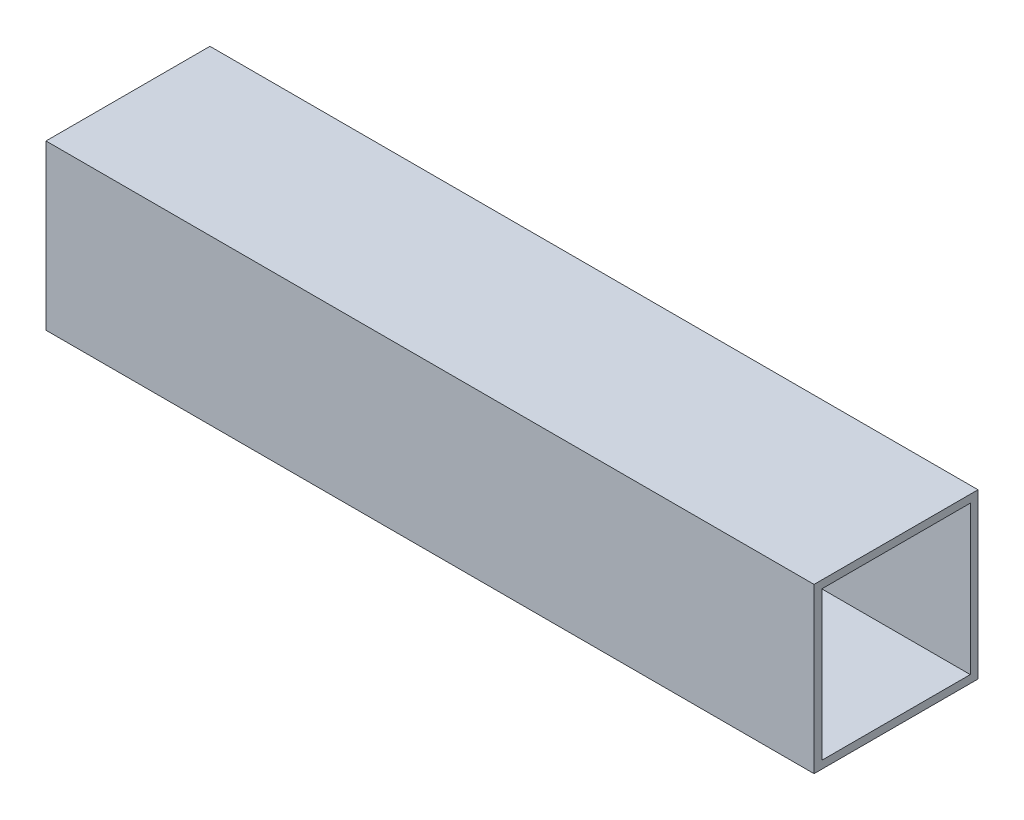
ISO-10303-21;
HEADER;
FILE_DESCRIPTION(('STEP AP214'),'2;1');
FILE_NAME('part.step','',(''),(''),'','','');
FILE_SCHEMA(('AUTOMOTIVE_DESIGN { 1 0 10303 214 1 1 1 1 }'));
ENDSEC;
DATA;
#1=APPLICATION_CONTEXT('core data for automotive mechanical design processes');
#2=APPLICATION_PROTOCOL_DEFINITION('international standard','automotive_design',2000,#1);
#3=PRODUCT_CONTEXT('',#1,'mechanical');
#4=PRODUCT('Part','Part','',(#3));
#5=PRODUCT_RELATED_PRODUCT_CATEGORY('part','',(#4));
#6=PRODUCT_DEFINITION_FORMATION('','',#4);
#7=PRODUCT_DEFINITION_CONTEXT('part definition',#1,'design');
#8=PRODUCT_DEFINITION('design','',#6,#7);
#9=PRODUCT_DEFINITION_SHAPE('','',#8);
#10=(LENGTH_UNIT() NAMED_UNIT(*) SI_UNIT(.MILLI.,.METRE.));
#11=(NAMED_UNIT(*) PLANE_ANGLE_UNIT() SI_UNIT($,.RADIAN.));
#12=(NAMED_UNIT(*) SI_UNIT($,.STERADIAN.) SOLID_ANGLE_UNIT());
#13=UNCERTAINTY_MEASURE_WITH_UNIT(LENGTH_MEASURE(1.E-05),#10,'distance_accuracy_value','');
#14=(GEOMETRIC_REPRESENTATION_CONTEXT(3) GLOBAL_UNCERTAINTY_ASSIGNED_CONTEXT((#13)) GLOBAL_UNIT_ASSIGNED_CONTEXT((#10,
#11,#12)) REPRESENTATION_CONTEXT('',''));
#15=CARTESIAN_POINT('',(0.,0.,0.));
#16=DIRECTION('',(0.,0.,1.));
#17=DIRECTION('',(1.,0.,0.));
#18=AXIS2_PLACEMENT_3D('',#15,#16,#17);
#19=CARTESIAN_POINT('',(0.,25.4,-25.3999999999999));
#20=DIRECTION('',(1.,0.,0.));
#21=DIRECTION('',(0.,0.,-1.));
#22=AXIS2_PLACEMENT_3D('',#19,#20,#21);
#23=PLANE('',#22);
#24=DIRECTION('',(0.,0.,1.));
#25=VECTOR('',#24,1.);
#26=CARTESIAN_POINT('',(0.,24.2,-25.3999999999999));
#27=LINE('',#26,#25);
#28=CARTESIAN_POINT('',(0.,24.2,-24.2));
#29=VERTEX_POINT('',#28);
#30=CARTESIAN_POINT('',(0.,24.2,-1.2));
#31=VERTEX_POINT('',#30);
#32=EDGE_CURVE('E148',#29,#31,#27,.T.);
#33=ORIENTED_EDGE('',*,*,#32,.T.);
#34=DIRECTION('',(0.,-1.,0.));
#35=VECTOR('',#34,1.);
#36=CARTESIAN_POINT('',(0.,25.4,-1.2));
#37=LINE('',#36,#35);
#38=CARTESIAN_POINT('',(0.,1.2,-1.2));
#39=VERTEX_POINT('',#38);
#40=EDGE_CURVE('E152',#31,#39,#37,.T.);
#41=ORIENTED_EDGE('',*,*,#40,.T.);
#42=DIRECTION('',(0.,0.,-1.));
#43=VECTOR('',#42,1.);
#44=CARTESIAN_POINT('',(0.,1.2,-25.3999999999999));
#45=LINE('',#44,#43);
#46=CARTESIAN_POINT('',(0.,1.2,-24.2));
#47=VERTEX_POINT('',#46);
#48=EDGE_CURVE('E139',#39,#47,#45,.T.);
#49=ORIENTED_EDGE('',*,*,#48,.T.);
#50=DIRECTION('',(0.,1.,0.));
#51=VECTOR('',#50,1.);
#52=CARTESIAN_POINT('',(0.,25.4,-24.2));
#53=LINE('',#52,#51);
#54=EDGE_CURVE('E114',#47,#29,#53,.T.);
#55=ORIENTED_EDGE('',*,*,#54,.T.);
#56=EDGE_LOOP('',(#33,#41,#49,#55));
#57=FACE_BOUND('',#56,.T.);
#58=DIRECTION('',(0.,0.,1.));
#59=VECTOR('',#58,1.);
#60=CARTESIAN_POINT('',(0.,0.,-25.3999999999999));
#61=LINE('',#60,#59);
#62=CARTESIAN_POINT('',(0.,0.,-25.3999999999999));
#63=VERTEX_POINT('',#62);
#64=CARTESIAN_POINT('',(0.,0.,0.));
#65=VERTEX_POINT('',#64);
#66=EDGE_CURVE('E156',#63,#65,#61,.T.);
#67=ORIENTED_EDGE('',*,*,#66,.T.);
#68=DIRECTION('',(0.,-1.,0.));
#69=VECTOR('',#68,1.);
#70=CARTESIAN_POINT('',(0.,25.4,0.));
#71=LINE('',#70,#69);
#72=CARTESIAN_POINT('',(0.,25.4,0.));
#73=VERTEX_POINT('',#72);
#74=EDGE_CURVE('E11',#73,#65,#71,.T.);
#75=ORIENTED_EDGE('',*,*,#74,.F.);
#76=DIRECTION('',(0.,0.,1.));
#77=VECTOR('',#76,1.);
#78=CARTESIAN_POINT('',(0.,25.4,-25.3999999999999));
#79=LINE('',#78,#77);
#80=CARTESIAN_POINT('',(0.,25.4,-25.3999999999999));
#81=VERTEX_POINT('',#80);
#82=EDGE_CURVE('E157',#81,#73,#79,.T.);
#83=ORIENTED_EDGE('',*,*,#82,.F.);
#84=DIRECTION('',(0.,-1.,0.));
#85=VECTOR('',#84,1.);
#86=CARTESIAN_POINT('',(0.,25.4,-25.3999999999999));
#87=LINE('',#86,#85);
#88=EDGE_CURVE('E171',#81,#63,#87,.T.);
#89=ORIENTED_EDGE('',*,*,#88,.T.);
#90=EDGE_LOOP('',(#67,#75,#83,#89));
#91=FACE_BOUND('',#90,.T.);
#92=ADVANCED_FACE('F43',(#57,#91),#23,.F.);
#93=CARTESIAN_POINT('',(0.,25.4,0.));
#94=DIRECTION('',(0.,0.,-1.));
#95=DIRECTION('',(-1.,0.,0.));
#96=AXIS2_PLACEMENT_3D('',#93,#94,#95);
#97=PLANE('',#96);
#98=DIRECTION('',(1.,0.,0.));
#99=VECTOR('',#98,1.);
#100=CARTESIAN_POINT('',(0.,0.,0.));
#101=LINE('',#100,#99);
#102=CARTESIAN_POINT('',(119.,0.,0.));
#103=VERTEX_POINT('',#102);
#104=EDGE_CURVE('E175',#65,#103,#101,.T.);
#105=ORIENTED_EDGE('',*,*,#104,.T.);
#106=DIRECTION('',(0.,-1.,0.));
#107=VECTOR('',#106,1.);
#108=CARTESIAN_POINT('',(119.,25.4,0.));
#109=LINE('',#108,#107);
#110=CARTESIAN_POINT('',(119.,25.4,0.));
#111=VERTEX_POINT('',#110);
#112=EDGE_CURVE('E51',#111,#103,#109,.T.);
#113=ORIENTED_EDGE('',*,*,#112,.F.);
#114=DIRECTION('',(1.,0.,0.));
#115=VECTOR('',#114,1.);
#116=CARTESIAN_POINT('',(0.,25.4,0.));
#117=LINE('',#116,#115);
#118=EDGE_CURVE('E161',#73,#111,#117,.T.);
#119=ORIENTED_EDGE('',*,*,#118,.F.);
#120=ORIENTED_EDGE('',*,*,#74,.T.);
#121=EDGE_LOOP('',(#105,#113,#119,#120));
#122=FACE_BOUND('',#121,.T.);
#123=ADVANCED_FACE('F209',(#122),#97,.F.);
#124=CARTESIAN_POINT('',(119.,25.4,0.));
#125=DIRECTION('',(-1.,0.,0.));
#126=DIRECTION('',(0.,0.,1.));
#127=AXIS2_PLACEMENT_3D('',#124,#125,#126);
#128=PLANE('',#127);
#129=DIRECTION('',(0.,0.,-1.));
#130=VECTOR('',#129,1.);
#131=CARTESIAN_POINT('',(119.,1.2,-1.2));
#132=LINE('',#131,#130);
#133=CARTESIAN_POINT('',(119.,1.2,-1.2));
#134=VERTEX_POINT('',#133);
#135=CARTESIAN_POINT('',(119.,1.2,-24.2));
#136=VERTEX_POINT('',#135);
#137=EDGE_CURVE('E121',#134,#136,#132,.T.);
#138=ORIENTED_EDGE('',*,*,#137,.F.);
#139=DIRECTION('',(0.,-1.,0.));
#140=VECTOR('',#139,1.);
#141=CARTESIAN_POINT('',(119.,24.2,-1.2));
#142=LINE('',#141,#140);
#143=CARTESIAN_POINT('',(119.,24.2,-1.2));
#144=VERTEX_POINT('',#143);
#145=EDGE_CURVE('E66',#144,#134,#142,.T.);
#146=ORIENTED_EDGE('',*,*,#145,.F.);
#147=DIRECTION('',(0.,0.,1.));
#148=VECTOR('',#147,1.);
#149=CARTESIAN_POINT('',(119.,24.2,-1.2));
#150=LINE('',#149,#148);
#151=CARTESIAN_POINT('',(119.,24.2,-24.2));
#152=VERTEX_POINT('',#151);
#153=EDGE_CURVE('E129',#152,#144,#150,.T.);
#154=ORIENTED_EDGE('',*,*,#153,.F.);
#155=DIRECTION('',(0.,1.,0.));
#156=VECTOR('',#155,1.);
#157=CARTESIAN_POINT('',(119.,24.2,-24.2));
#158=LINE('',#157,#156);
#159=EDGE_CURVE('E111',#136,#152,#158,.T.);
#160=ORIENTED_EDGE('',*,*,#159,.F.);
#161=EDGE_LOOP('',(#138,#146,#154,#160));
#162=FACE_BOUND('',#161,.T.);
#163=DIRECTION('',(0.,0.,-1.));
#164=VECTOR('',#163,1.);
#165=CARTESIAN_POINT('',(119.,0.,0.));
#166=LINE('',#165,#164);
#167=CARTESIAN_POINT('',(119.,0.,-25.4));
#168=VERTEX_POINT('',#167);
#169=EDGE_CURVE('E178',#103,#168,#166,.T.);
#170=ORIENTED_EDGE('',*,*,#169,.T.);
#171=DIRECTION('',(0.,-1.,0.));
#172=VECTOR('',#171,1.);
#173=CARTESIAN_POINT('',(119.,25.4,-25.4));
#174=LINE('',#173,#172);
#175=CARTESIAN_POINT('',(119.,25.4,-25.4));
#176=VERTEX_POINT('',#175);
#177=EDGE_CURVE('E186',#176,#168,#174,.T.);
#178=ORIENTED_EDGE('',*,*,#177,.F.);
#179=DIRECTION('',(0.,0.,-1.));
#180=VECTOR('',#179,1.);
#181=CARTESIAN_POINT('',(119.,25.4,0.));
#182=LINE('',#181,#180);
#183=EDGE_CURVE('E165',#111,#176,#182,.T.);
#184=ORIENTED_EDGE('',*,*,#183,.F.);
#185=ORIENTED_EDGE('',*,*,#112,.T.);
#186=EDGE_LOOP('',(#170,#178,#184,#185));
#187=FACE_BOUND('',#186,.T.);
#188=ADVANCED_FACE('F126',(#162,#187),#128,.F.);
#189=CARTESIAN_POINT('',(119.,25.4,-25.4));
#190=DIRECTION('',(0.,0.,1.));
#191=DIRECTION('',(1.,0.,0.));
#192=AXIS2_PLACEMENT_3D('',#189,#190,#191);
#193=PLANE('',#192);
#194=DIRECTION('',(-1.,0.,0.));
#195=VECTOR('',#194,1.);
#196=CARTESIAN_POINT('',(119.,0.,-25.4));
#197=LINE('',#196,#195);
#198=EDGE_CURVE('E162',#168,#63,#197,.T.);
#199=ORIENTED_EDGE('',*,*,#198,.T.);
#200=ORIENTED_EDGE('',*,*,#88,.F.);
#201=DIRECTION('',(-1.,0.,0.));
#202=VECTOR('',#201,1.);
#203=CARTESIAN_POINT('',(119.,25.4,-25.4));
#204=LINE('',#203,#202);
#205=EDGE_CURVE('E168',#176,#81,#204,.T.);
#206=ORIENTED_EDGE('',*,*,#205,.F.);
#207=ORIENTED_EDGE('',*,*,#177,.T.);
#208=EDGE_LOOP('',(#199,#200,#206,#207));
#209=FACE_BOUND('',#208,.T.);
#210=ADVANCED_FACE('F202',(#209),#193,.F.);
#211=CARTESIAN_POINT('',(0.,25.4,0.));
#212=DIRECTION('',(0.,1.,0.));
#213=DIRECTION('',(0.,0.,1.));
#214=AXIS2_PLACEMENT_3D('',#211,#212,#213);
#215=PLANE('',#214);
#216=ORIENTED_EDGE('',*,*,#82,.T.);
#217=ORIENTED_EDGE('',*,*,#118,.T.);
#218=ORIENTED_EDGE('',*,*,#183,.T.);
#219=ORIENTED_EDGE('',*,*,#205,.T.);
#220=EDGE_LOOP('',(#216,#217,#218,#219));
#221=FACE_BOUND('',#220,.T.);
#222=ADVANCED_FACE('F208',(#221),#215,.T.);
#223=CARTESIAN_POINT('',(0.,0.,0.));
#224=DIRECTION('',(0.,1.,0.));
#225=DIRECTION('',(0.,0.,1.));
#226=AXIS2_PLACEMENT_3D('',#223,#224,#225);
#227=PLANE('',#226);
#228=ORIENTED_EDGE('',*,*,#66,.F.);
#229=ORIENTED_EDGE('',*,*,#198,.F.);
#230=ORIENTED_EDGE('',*,*,#169,.F.);
#231=ORIENTED_EDGE('',*,*,#104,.F.);
#232=EDGE_LOOP('',(#228,#229,#230,#231));
#233=FACE_BOUND('',#232,.T.);
#234=ADVANCED_FACE('F199',(#233),#227,.F.);
#235=CARTESIAN_POINT('',(-331.,24.2,-1.2));
#236=DIRECTION('',(0.,0.,1.));
#237=DIRECTION('',(0.,-1.,0.));
#238=AXIS2_PLACEMENT_3D('',#235,#236,#237);
#239=PLANE('',#238);
#240=DIRECTION('',(1.,0.,0.));
#241=VECTOR('',#240,1.);
#242=CARTESIAN_POINT('',(-331.,24.2,-1.2));
#243=LINE('',#242,#241);
#244=EDGE_CURVE('E136',#31,#144,#243,.T.);
#245=ORIENTED_EDGE('',*,*,#244,.T.);
#246=ORIENTED_EDGE('',*,*,#145,.T.);
#247=DIRECTION('',(1.,0.,0.));
#248=VECTOR('',#247,1.);
#249=CARTESIAN_POINT('',(-331.,1.2,-1.2));
#250=LINE('',#249,#248);
#251=EDGE_CURVE('E118',#39,#134,#250,.T.);
#252=ORIENTED_EDGE('',*,*,#251,.F.);
#253=ORIENTED_EDGE('',*,*,#40,.F.);
#254=EDGE_LOOP('',(#245,#246,#252,#253));
#255=FACE_BOUND('',#254,.T.);
#256=ADVANCED_FACE('F222',(#255),#239,.F.);
#257=CARTESIAN_POINT('',(-331.,24.2,-1.2));
#258=DIRECTION('',(0.,1.,0.));
#259=DIRECTION('',(0.,0.,1.));
#260=AXIS2_PLACEMENT_3D('',#257,#258,#259);
#261=PLANE('',#260);
#262=DIRECTION('',(1.,0.,0.));
#263=VECTOR('',#262,1.);
#264=CARTESIAN_POINT('',(-331.,24.2,-24.2));
#265=LINE('',#264,#263);
#266=EDGE_CURVE('E117',#29,#152,#265,.T.);
#267=ORIENTED_EDGE('',*,*,#266,.T.);
#268=ORIENTED_EDGE('',*,*,#153,.T.);
#269=ORIENTED_EDGE('',*,*,#244,.F.);
#270=ORIENTED_EDGE('',*,*,#32,.F.);
#271=EDGE_LOOP('',(#267,#268,#269,#270));
#272=FACE_BOUND('',#271,.T.);
#273=ADVANCED_FACE('F227',(#272),#261,.F.);
#274=CARTESIAN_POINT('',(-331.,24.2,-24.2));
#275=DIRECTION('',(0.,0.,-1.));
#276=DIRECTION('',(0.,1.,0.));
#277=AXIS2_PLACEMENT_3D('',#274,#275,#276);
#278=PLANE('',#277);
#279=DIRECTION('',(1.,0.,0.));
#280=VECTOR('',#279,1.);
#281=CARTESIAN_POINT('',(-331.,1.2,-24.2));
#282=LINE('',#281,#280);
#283=EDGE_CURVE('E58',#47,#136,#282,.T.);
#284=ORIENTED_EDGE('',*,*,#283,.T.);
#285=ORIENTED_EDGE('',*,*,#159,.T.);
#286=ORIENTED_EDGE('',*,*,#266,.F.);
#287=ORIENTED_EDGE('',*,*,#54,.F.);
#288=EDGE_LOOP('',(#284,#285,#286,#287));
#289=FACE_BOUND('',#288,.T.);
#290=ADVANCED_FACE('F108',(#289),#278,.F.);
#291=CARTESIAN_POINT('',(-331.,1.2,-1.2));
#292=DIRECTION('',(0.,-1.,0.));
#293=DIRECTION('',(0.,0.,-1.));
#294=AXIS2_PLACEMENT_3D('',#291,#292,#293);
#295=PLANE('',#294);
#296=ORIENTED_EDGE('',*,*,#251,.T.);
#297=ORIENTED_EDGE('',*,*,#137,.T.);
#298=ORIENTED_EDGE('',*,*,#283,.F.);
#299=ORIENTED_EDGE('',*,*,#48,.F.);
#300=EDGE_LOOP('',(#296,#297,#298,#299));
#301=FACE_BOUND('',#300,.T.);
#302=ADVANCED_FACE('F122',(#301),#295,.F.);
#303=CLOSED_SHELL('',(#92,#123,#188,#210,#222,#234,#256,#273,#290,#302));
#304=MANIFOLD_SOLID_BREP('B2',#303);
#305=ADVANCED_BREP_SHAPE_REPRESENTATION('',(#18,#304),#14);
#306=SHAPE_DEFINITION_REPRESENTATION(#9,#305);
ENDSEC;
END-ISO-10303-21;
